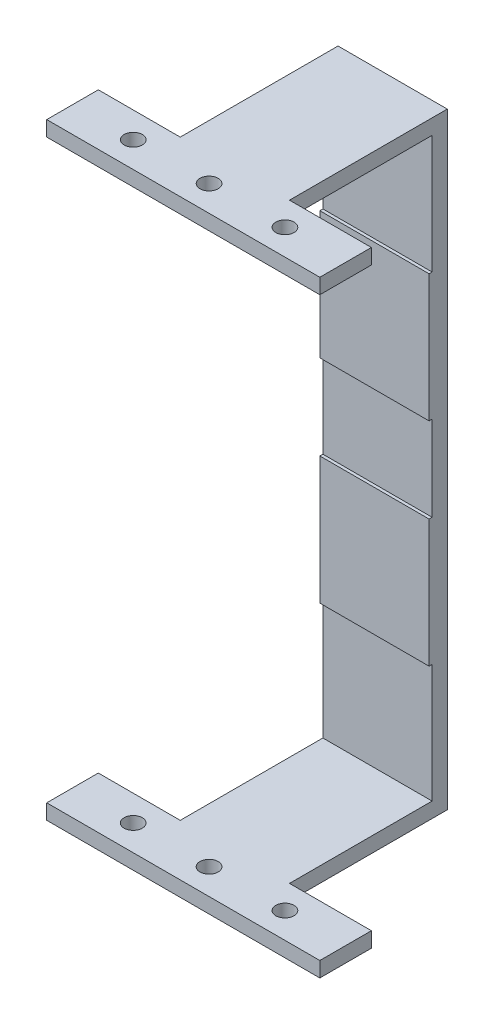
ISO-10303-21;
HEADER;
FILE_DESCRIPTION(('STEP AP214'),'2;1');
FILE_NAME('part.step','',(''),(''),'','','');
FILE_SCHEMA(('AUTOMOTIVE_DESIGN { 1 0 10303 214 1 1 1 1 }'));
ENDSEC;
DATA;
#1=APPLICATION_CONTEXT('core data for automotive mechanical design processes');
#2=APPLICATION_PROTOCOL_DEFINITION('international standard','automotive_design',2000,#1);
#3=PRODUCT_CONTEXT('',#1,'mechanical');
#4=PRODUCT('Part','Part','',(#3));
#5=PRODUCT_RELATED_PRODUCT_CATEGORY('part','',(#4));
#6=PRODUCT_DEFINITION_FORMATION('','',#4);
#7=PRODUCT_DEFINITION_CONTEXT('part definition',#1,'design');
#8=PRODUCT_DEFINITION('design','',#6,#7);
#9=PRODUCT_DEFINITION_SHAPE('','',#8);
#10=(LENGTH_UNIT() NAMED_UNIT(*) SI_UNIT(.MILLI.,.METRE.));
#11=(NAMED_UNIT(*) PLANE_ANGLE_UNIT() SI_UNIT($,.RADIAN.));
#12=(NAMED_UNIT(*) SI_UNIT($,.STERADIAN.) SOLID_ANGLE_UNIT());
#13=UNCERTAINTY_MEASURE_WITH_UNIT(LENGTH_MEASURE(1.E-05),#10,'distance_accuracy_value','');
#14=(GEOMETRIC_REPRESENTATION_CONTEXT(3) GLOBAL_UNCERTAINTY_ASSIGNED_CONTEXT((#13)) GLOBAL_UNIT_ASSIGNED_CONTEXT((#10,
#11,#12)) REPRESENTATION_CONTEXT('',''));
#15=CARTESIAN_POINT('',(0.,0.,0.));
#16=DIRECTION('',(0.,0.,1.));
#17=DIRECTION('',(1.,0.,0.));
#18=AXIS2_PLACEMENT_3D('',#15,#16,#17);
#19=CARTESIAN_POINT('',(45.,100.,-5.));
#20=DIRECTION('',(1.,0.,0.));
#21=DIRECTION('',(0.,1.,0.));
#22=AXIS2_PLACEMENT_3D('',#19,#20,#21);
#23=PLANE('',#22);
#24=DIRECTION('',(0.,0.,1.));
#25=VECTOR('',#24,1.);
#26=CARTESIAN_POINT('',(45.,-100.,-5.));
#27=LINE('',#26,#25);
#28=CARTESIAN_POINT('',(45.,-100.,47.));
#29=VERTEX_POINT('',#28);
#30=CARTESIAN_POINT('',(45.,-100.,64.));
#31=VERTEX_POINT('',#30);
#32=EDGE_CURVE('E237',#29,#31,#27,.T.);
#33=ORIENTED_EDGE('',*,*,#32,.F.);
#34=DIRECTION('',(0.,1.,0.));
#35=VECTOR('',#34,1.);
#36=CARTESIAN_POINT('',(45.,-100.,47.));
#37=LINE('',#36,#35);
#38=CARTESIAN_POINT('',(45.,-95.,47.));
#39=VERTEX_POINT('',#38);
#40=EDGE_CURVE('E259',#29,#39,#37,.T.);
#41=ORIENTED_EDGE('',*,*,#40,.T.);
#42=DIRECTION('',(0.,0.,-1.));
#43=VECTOR('',#42,1.);
#44=CARTESIAN_POINT('',(45.,-95.,64.));
#45=LINE('',#44,#43);
#46=CARTESIAN_POINT('',(45.,-95.,64.));
#47=VERTEX_POINT('',#46);
#48=EDGE_CURVE('E269',#47,#39,#45,.T.);
#49=ORIENTED_EDGE('',*,*,#48,.F.);
#50=DIRECTION('',(0.,1.,0.));
#51=VECTOR('',#50,1.);
#52=CARTESIAN_POINT('',(45.,-100.,64.));
#53=LINE('',#52,#51);
#54=EDGE_CURVE('E432',#31,#47,#53,.T.);
#55=ORIENTED_EDGE('',*,*,#54,.F.);
#56=EDGE_LOOP('',(#33,#41,#49,#55));
#57=FACE_BOUND('',#56,.T.);
#58=ADVANCED_FACE('F40',(#57),#23,.T.);
#59=DIRECTION('',(0.,0.,-1.));
#60=VECTOR('',#59,1.);
#61=CARTESIAN_POINT('',(45.,95.,64.));
#62=LINE('',#61,#60);
#63=CARTESIAN_POINT('',(45.,95.,64.));
#64=VERTEX_POINT('',#63);
#65=CARTESIAN_POINT('',(45.,95.,47.));
#66=VERTEX_POINT('',#65);
#67=EDGE_CURVE('E297',#64,#66,#62,.T.);
#68=ORIENTED_EDGE('',*,*,#67,.T.);
#69=CARTESIAN_POINT('',(45.,100.,47.));
#70=VERTEX_POINT('',#69);
#71=EDGE_CURVE('E272',#66,#70,#37,.T.);
#72=ORIENTED_EDGE('',*,*,#71,.T.);
#73=DIRECTION('',(0.,0.,1.));
#74=VECTOR('',#73,1.);
#75=CARTESIAN_POINT('',(45.,100.,-5.));
#76=LINE('',#75,#74);
#77=CARTESIAN_POINT('',(45.,100.,64.));
#78=VERTEX_POINT('',#77);
#79=EDGE_CURVE('E228',#70,#78,#76,.T.);
#80=ORIENTED_EDGE('',*,*,#79,.T.);
#81=DIRECTION('',(0.,1.,0.));
#82=VECTOR('',#81,1.);
#83=CARTESIAN_POINT('',(45.,100.,64.));
#84=LINE('',#83,#82);
#85=EDGE_CURVE('E292',#64,#78,#84,.T.);
#86=ORIENTED_EDGE('',*,*,#85,.F.);
#87=EDGE_LOOP('',(#68,#72,#80,#86));
#88=FACE_BOUND('',#87,.T.);
#89=ADVANCED_FACE('F488',(#88),#23,.T.);
#90=CARTESIAN_POINT('',(-45.,-100.,-5.));
#91=DIRECTION('',(0.,-1.,0.));
#92=DIRECTION('',(0.,0.,-1.));
#93=AXIS2_PLACEMENT_3D('',#90,#91,#92);
#94=PLANE('',#93);
#95=CARTESIAN_POINT('',(-25.,-100.,55.5));
#96=DIRECTION('',(0.,1.,0.));
#97=DIRECTION('',(0.,0.,1.));
#98=AXIS2_PLACEMENT_3D('',#95,#96,#97);
#99=CIRCLE('',#98,3.);
#100=CARTESIAN_POINT('',(-25.,-100.,58.5));
#101=VERTEX_POINT('',#100);
#102=EDGE_CURVE('E246',#101,#101,#99,.T.);
#103=ORIENTED_EDGE('',*,*,#102,.T.);
#104=EDGE_LOOP('',(#103));
#105=FACE_BOUND('',#104,.T.);
#106=CARTESIAN_POINT('',(0.,-100.,55.5));
#107=DIRECTION('',(0.,1.,0.));
#108=DIRECTION('',(0.,0.,1.));
#109=AXIS2_PLACEMENT_3D('',#106,#107,#108);
#110=CIRCLE('',#109,3.);
#111=CARTESIAN_POINT('',(0.,-100.,58.5));
#112=VERTEX_POINT('',#111);
#113=EDGE_CURVE('E355',#112,#112,#110,.T.);
#114=ORIENTED_EDGE('',*,*,#113,.T.);
#115=EDGE_LOOP('',(#114));
#116=FACE_BOUND('',#115,.T.);
#117=CARTESIAN_POINT('',(25.,-100.,55.5));
#118=DIRECTION('',(0.,1.,0.));
#119=DIRECTION('',(0.,0.,1.));
#120=AXIS2_PLACEMENT_3D('',#117,#118,#119);
#121=CIRCLE('',#120,3.);
#122=CARTESIAN_POINT('',(25.,-100.,58.5));
#123=VERTEX_POINT('',#122);
#124=EDGE_CURVE('E361',#123,#123,#121,.T.);
#125=ORIENTED_EDGE('',*,*,#124,.T.);
#126=EDGE_LOOP('',(#125));
#127=FACE_BOUND('',#126,.T.);
#128=DIRECTION('',(1.,0.,0.));
#129=VECTOR('',#128,1.);
#130=CARTESIAN_POINT('',(0.,-100.,47.));
#131=LINE('',#130,#129);
#132=CARTESIAN_POINT('',(-45.,-100.,47.));
#133=VERTEX_POINT('',#132);
#134=CARTESIAN_POINT('',(-18.,-100.,47.));
#135=VERTEX_POINT('',#134);
#136=EDGE_CURVE('E222',#133,#135,#131,.T.);
#137=ORIENTED_EDGE('',*,*,#136,.T.);
#138=DIRECTION('',(0.,0.,1.));
#139=VECTOR('',#138,1.);
#140=CARTESIAN_POINT('',(-18.,-100.,0.));
#141=LINE('',#140,#139);
#142=CARTESIAN_POINT('',(-18.,-100.,-5.));
#143=VERTEX_POINT('',#142);
#144=EDGE_CURVE('E204',#143,#135,#141,.T.);
#145=ORIENTED_EDGE('',*,*,#144,.F.);
#146=DIRECTION('',(1.,0.,0.));
#147=VECTOR('',#146,1.);
#148=CARTESIAN_POINT('',(-45.,-100.,-5.));
#149=LINE('',#148,#147);
#150=CARTESIAN_POINT('',(18.,-100.,-5.));
#151=VERTEX_POINT('',#150);
#152=EDGE_CURVE('E220',#143,#151,#149,.T.);
#153=ORIENTED_EDGE('',*,*,#152,.T.);
#154=DIRECTION('',(0.,0.,1.));
#155=VECTOR('',#154,1.);
#156=CARTESIAN_POINT('',(18.,-100.,-5.));
#157=LINE('',#156,#155);
#158=CARTESIAN_POINT('',(18.,-100.,47.));
#159=VERTEX_POINT('',#158);
#160=EDGE_CURVE('E271',#151,#159,#157,.T.);
#161=ORIENTED_EDGE('',*,*,#160,.T.);
#162=DIRECTION('',(-1.,0.,0.));
#163=VECTOR('',#162,1.);
#164=CARTESIAN_POINT('',(45.,-100.,47.));
#165=LINE('',#164,#163);
#166=EDGE_CURVE('E325',#29,#159,#165,.T.);
#167=ORIENTED_EDGE('',*,*,#166,.F.);
#168=ORIENTED_EDGE('',*,*,#32,.T.);
#169=DIRECTION('',(1.,0.,0.));
#170=VECTOR('',#169,1.);
#171=CARTESIAN_POINT('',(-45.,-100.,64.));
#172=LINE('',#171,#170);
#173=CARTESIAN_POINT('',(-45.,-100.,64.));
#174=VERTEX_POINT('',#173);
#175=EDGE_CURVE('E429',#174,#31,#172,.T.);
#176=ORIENTED_EDGE('',*,*,#175,.F.);
#177=DIRECTION('',(0.,0.,1.));
#178=VECTOR('',#177,1.);
#179=CARTESIAN_POINT('',(-45.,-100.,-5.));
#180=LINE('',#179,#178);
#181=EDGE_CURVE('E239',#133,#174,#180,.T.);
#182=ORIENTED_EDGE('',*,*,#181,.F.);
#183=EDGE_LOOP('',(#137,#145,#153,#161,#167,#168,#176,#182));
#184=FACE_BOUND('',#183,.T.);
#185=ADVANCED_FACE('F218',(#105,#116,#127,#184),#94,.T.);
#186=CARTESIAN_POINT('',(-45.,100.,-5.));
#187=DIRECTION('',(0.,1.,0.));
#188=DIRECTION('',(0.,0.,1.));
#189=AXIS2_PLACEMENT_3D('',#186,#187,#188);
#190=PLANE('',#189);
#191=CARTESIAN_POINT('',(-25.,100.,55.5));
#192=DIRECTION('',(0.,1.,0.));
#193=DIRECTION('',(0.,0.,1.));
#194=AXIS2_PLACEMENT_3D('',#191,#192,#193);
#195=CIRCLE('',#194,3.);
#196=CARTESIAN_POINT('',(-25.,100.,58.5));
#197=VERTEX_POINT('',#196);
#198=EDGE_CURVE('E352',#197,#197,#195,.T.);
#199=ORIENTED_EDGE('',*,*,#198,.F.);
#200=EDGE_LOOP('',(#199));
#201=FACE_BOUND('',#200,.T.);
#202=CARTESIAN_POINT('',(0.,100.,55.5));
#203=DIRECTION('',(0.,1.,0.));
#204=DIRECTION('',(0.,0.,1.));
#205=AXIS2_PLACEMENT_3D('',#202,#203,#204);
#206=CIRCLE('',#205,3.);
#207=CARTESIAN_POINT('',(0.,100.,58.5));
#208=VERTEX_POINT('',#207);
#209=EDGE_CURVE('E358',#208,#208,#206,.T.);
#210=ORIENTED_EDGE('',*,*,#209,.F.);
#211=EDGE_LOOP('',(#210));
#212=FACE_BOUND('',#211,.T.);
#213=CARTESIAN_POINT('',(25.,100.,55.5));
#214=DIRECTION('',(0.,1.,0.));
#215=DIRECTION('',(0.,0.,1.));
#216=AXIS2_PLACEMENT_3D('',#213,#214,#215);
#217=CIRCLE('',#216,3.);
#218=CARTESIAN_POINT('',(25.,100.,58.5));
#219=VERTEX_POINT('',#218);
#220=EDGE_CURVE('E212',#219,#219,#217,.T.);
#221=ORIENTED_EDGE('',*,*,#220,.F.);
#222=EDGE_LOOP('',(#221));
#223=FACE_BOUND('',#222,.T.);
#224=DIRECTION('',(-1.,0.,0.));
#225=VECTOR('',#224,1.);
#226=CARTESIAN_POINT('',(-45.,100.,-5.));
#227=LINE('',#226,#225);
#228=CARTESIAN_POINT('',(18.,100.,-5.));
#229=VERTEX_POINT('',#228);
#230=CARTESIAN_POINT('',(-18.,100.,-5.));
#231=VERTEX_POINT('',#230);
#232=EDGE_CURVE('E229',#229,#231,#227,.T.);
#233=ORIENTED_EDGE('',*,*,#232,.T.);
#234=DIRECTION('',(0.,0.,1.));
#235=VECTOR('',#234,1.);
#236=CARTESIAN_POINT('',(-18.,100.,0.));
#237=LINE('',#236,#235);
#238=CARTESIAN_POINT('',(-18.,100.,47.));
#239=VERTEX_POINT('',#238);
#240=EDGE_CURVE('E207',#231,#239,#237,.T.);
#241=ORIENTED_EDGE('',*,*,#240,.T.);
#242=DIRECTION('',(1.,0.,0.));
#243=VECTOR('',#242,1.);
#244=CARTESIAN_POINT('',(0.,100.,47.));
#245=LINE('',#244,#243);
#246=CARTESIAN_POINT('',(-45.,100.,47.));
#247=VERTEX_POINT('',#246);
#248=EDGE_CURVE('E223',#247,#239,#245,.T.);
#249=ORIENTED_EDGE('',*,*,#248,.F.);
#250=DIRECTION('',(0.,0.,1.));
#251=VECTOR('',#250,1.);
#252=CARTESIAN_POINT('',(-45.,100.,-5.));
#253=LINE('',#252,#251);
#254=CARTESIAN_POINT('',(-45.,100.,64.));
#255=VERTEX_POINT('',#254);
#256=EDGE_CURVE('E231',#247,#255,#253,.T.);
#257=ORIENTED_EDGE('',*,*,#256,.T.);
#258=DIRECTION('',(-1.,0.,0.));
#259=VECTOR('',#258,1.);
#260=CARTESIAN_POINT('',(-45.,100.,64.));
#261=LINE('',#260,#259);
#262=EDGE_CURVE('E295',#78,#255,#261,.T.);
#263=ORIENTED_EDGE('',*,*,#262,.F.);
#264=ORIENTED_EDGE('',*,*,#79,.F.);
#265=DIRECTION('',(-1.,0.,0.));
#266=VECTOR('',#265,1.);
#267=CARTESIAN_POINT('',(45.,100.,47.));
#268=LINE('',#267,#266);
#269=CARTESIAN_POINT('',(18.,100.,47.));
#270=VERTEX_POINT('',#269);
#271=EDGE_CURVE('E324',#70,#270,#268,.T.);
#272=ORIENTED_EDGE('',*,*,#271,.T.);
#273=DIRECTION('',(0.,0.,1.));
#274=VECTOR('',#273,1.);
#275=CARTESIAN_POINT('',(18.,100.,-5.));
#276=LINE('',#275,#274);
#277=EDGE_CURVE('E322',#229,#270,#276,.T.);
#278=ORIENTED_EDGE('',*,*,#277,.F.);
#279=EDGE_LOOP('',(#233,#241,#249,#257,#263,#264,#272,#278));
#280=FACE_BOUND('',#279,.T.);
#281=ADVANCED_FACE('F496',(#201,#212,#223,#280),#190,.T.);
#282=CARTESIAN_POINT('',(0.,0.,-5.));
#283=DIRECTION('',(0.,0.,1.));
#284=DIRECTION('',(1.,0.,0.));
#285=AXIS2_PLACEMENT_3D('',#282,#283,#284);
#286=PLANE('',#285);
#287=DIRECTION('',(0.,1.,0.));
#288=VECTOR('',#287,1.);
#289=CARTESIAN_POINT('',(-18.,95.,-5.));
#290=LINE('',#289,#288);
#291=EDGE_CURVE('E199',#143,#231,#290,.T.);
#292=ORIENTED_EDGE('',*,*,#291,.T.);
#293=ORIENTED_EDGE('',*,*,#232,.F.);
#294=DIRECTION('',(0.,-1.,0.));
#295=VECTOR('',#294,1.);
#296=CARTESIAN_POINT('',(18.,95.,-5.));
#297=LINE('',#296,#295);
#298=EDGE_CURVE('E226',#229,#151,#297,.T.);
#299=ORIENTED_EDGE('',*,*,#298,.T.);
#300=ORIENTED_EDGE('',*,*,#152,.F.);
#301=EDGE_LOOP('',(#292,#293,#299,#300));
#302=FACE_BOUND('',#301,.T.);
#303=ADVANCED_FACE('F225',(#302),#286,.F.);
#304=CARTESIAN_POINT('',(-45.,95.,64.));
#305=DIRECTION('',(0.,1.,0.));
#306=DIRECTION('',(0.,0.,1.));
#307=AXIS2_PLACEMENT_3D('',#304,#305,#306);
#308=PLANE('',#307);
#309=CARTESIAN_POINT('',(-25.,95.,55.5));
#310=DIRECTION('',(0.,1.,0.));
#311=DIRECTION('',(0.,0.,1.));
#312=AXIS2_PLACEMENT_3D('',#309,#310,#311);
#313=CIRCLE('',#312,3.);
#314=CARTESIAN_POINT('',(-25.,95.,58.5));
#315=VERTEX_POINT('',#314);
#316=EDGE_CURVE('E253',#315,#315,#313,.T.);
#317=ORIENTED_EDGE('',*,*,#316,.T.);
#318=EDGE_LOOP('',(#317));
#319=FACE_BOUND('',#318,.T.);
#320=CARTESIAN_POINT('',(0.,95.,55.5));
#321=DIRECTION('',(0.,1.,0.));
#322=DIRECTION('',(0.,0.,1.));
#323=AXIS2_PLACEMENT_3D('',#320,#321,#322);
#324=CIRCLE('',#323,3.);
#325=CARTESIAN_POINT('',(0.,95.,58.5));
#326=VERTEX_POINT('',#325);
#327=EDGE_CURVE('E250',#326,#326,#324,.T.);
#328=ORIENTED_EDGE('',*,*,#327,.T.);
#329=EDGE_LOOP('',(#328));
#330=FACE_BOUND('',#329,.T.);
#331=CARTESIAN_POINT('',(25.,95.,55.5));
#332=DIRECTION('',(0.,1.,0.));
#333=DIRECTION('',(0.,0.,1.));
#334=AXIS2_PLACEMENT_3D('',#331,#332,#333);
#335=CIRCLE('',#334,3.);
#336=CARTESIAN_POINT('',(25.,95.,58.5));
#337=VERTEX_POINT('',#336);
#338=EDGE_CURVE('E245',#337,#337,#335,.T.);
#339=ORIENTED_EDGE('',*,*,#338,.T.);
#340=EDGE_LOOP('',(#339));
#341=FACE_BOUND('',#340,.T.);
#342=DIRECTION('',(0.,0.,1.));
#343=VECTOR('',#342,1.);
#344=CARTESIAN_POINT('',(-18.,95.,64.));
#345=LINE('',#344,#343);
#346=CARTESIAN_POINT('',(-18.,95.,0.));
#347=VERTEX_POINT('',#346);
#348=CARTESIAN_POINT('',(-18.,95.,47.));
#349=VERTEX_POINT('',#348);
#350=EDGE_CURVE('E332',#347,#349,#345,.T.);
#351=ORIENTED_EDGE('',*,*,#350,.F.);
#352=DIRECTION('',(1.,0.,0.));
#353=VECTOR('',#352,1.);
#354=CARTESIAN_POINT('',(-45.,95.,0.));
#355=LINE('',#354,#353);
#356=CARTESIAN_POINT('',(18.,95.,0.));
#357=VERTEX_POINT('',#356);
#358=EDGE_CURVE('E278',#347,#357,#355,.T.);
#359=ORIENTED_EDGE('',*,*,#358,.T.);
#360=DIRECTION('',(0.,0.,1.));
#361=VECTOR('',#360,1.);
#362=CARTESIAN_POINT('',(18.,95.,64.));
#363=LINE('',#362,#361);
#364=CARTESIAN_POINT('',(18.,95.,47.));
#365=VERTEX_POINT('',#364);
#366=EDGE_CURVE('E333',#357,#365,#363,.T.);
#367=ORIENTED_EDGE('',*,*,#366,.T.);
#368=DIRECTION('',(-1.,0.,0.));
#369=VECTOR('',#368,1.);
#370=CARTESIAN_POINT('',(-45.,95.,47.));
#371=LINE('',#370,#369);
#372=EDGE_CURVE('E338',#66,#365,#371,.T.);
#373=ORIENTED_EDGE('',*,*,#372,.F.);
#374=ORIENTED_EDGE('',*,*,#67,.F.);
#375=DIRECTION('',(1.,0.,0.));
#376=VECTOR('',#375,1.);
#377=CARTESIAN_POINT('',(-45.,95.,64.));
#378=LINE('',#377,#376);
#379=CARTESIAN_POINT('',(-45.,95.,64.));
#380=VERTEX_POINT('',#379);
#381=EDGE_CURVE('E290',#380,#64,#378,.T.);
#382=ORIENTED_EDGE('',*,*,#381,.F.);
#383=DIRECTION('',(0.,0.,-1.));
#384=VECTOR('',#383,1.);
#385=CARTESIAN_POINT('',(-45.,95.,64.));
#386=LINE('',#385,#384);
#387=CARTESIAN_POINT('',(-45.,95.,47.));
#388=VERTEX_POINT('',#387);
#389=EDGE_CURVE('E233',#380,#388,#386,.T.);
#390=ORIENTED_EDGE('',*,*,#389,.T.);
#391=DIRECTION('',(1.,0.,0.));
#392=VECTOR('',#391,1.);
#393=CARTESIAN_POINT('',(-45.,95.,47.));
#394=LINE('',#393,#392);
#395=EDGE_CURVE('E305',#388,#349,#394,.T.);
#396=ORIENTED_EDGE('',*,*,#395,.T.);
#397=EDGE_LOOP('',(#351,#359,#367,#373,#374,#382,#390,#396));
#398=FACE_BOUND('',#397,.T.);
#399=ADVANCED_FACE('F304',(#319,#330,#341,#398),#308,.F.);
#400=CARTESIAN_POINT('',(-45.,-95.,64.));
#401=DIRECTION('',(0.,-1.,0.));
#402=DIRECTION('',(0.,0.,-1.));
#403=AXIS2_PLACEMENT_3D('',#400,#401,#402);
#404=PLANE('',#403);
#405=CARTESIAN_POINT('',(-25.,-95.,55.5));
#406=DIRECTION('',(0.,-1.,0.));
#407=DIRECTION('',(0.,0.,-1.));
#408=AXIS2_PLACEMENT_3D('',#405,#406,#407);
#409=CIRCLE('',#408,3.);
#410=CARTESIAN_POINT('',(-25.,-95.,52.5));
#411=VERTEX_POINT('',#410);
#412=EDGE_CURVE('E251',#411,#411,#409,.T.);
#413=ORIENTED_EDGE('',*,*,#412,.T.);
#414=EDGE_LOOP('',(#413));
#415=FACE_BOUND('',#414,.T.);
#416=CARTESIAN_POINT('',(0.,-95.,55.5));
#417=DIRECTION('',(0.,-1.,0.));
#418=DIRECTION('',(0.,0.,-1.));
#419=AXIS2_PLACEMENT_3D('',#416,#417,#418);
#420=CIRCLE('',#419,3.);
#421=CARTESIAN_POINT('',(0.,-95.,52.5));
#422=VERTEX_POINT('',#421);
#423=EDGE_CURVE('E247',#422,#422,#420,.T.);
#424=ORIENTED_EDGE('',*,*,#423,.T.);
#425=EDGE_LOOP('',(#424));
#426=FACE_BOUND('',#425,.T.);
#427=CARTESIAN_POINT('',(25.,-95.,55.5));
#428=DIRECTION('',(0.,-1.,0.));
#429=DIRECTION('',(0.,0.,-1.));
#430=AXIS2_PLACEMENT_3D('',#427,#428,#429);
#431=CIRCLE('',#430,3.);
#432=CARTESIAN_POINT('',(25.,-95.,52.5));
#433=VERTEX_POINT('',#432);
#434=EDGE_CURVE('E242',#433,#433,#431,.T.);
#435=ORIENTED_EDGE('',*,*,#434,.T.);
#436=EDGE_LOOP('',(#435));
#437=FACE_BOUND('',#436,.T.);
#438=DIRECTION('',(0.,0.,-1.));
#439=VECTOR('',#438,1.);
#440=CARTESIAN_POINT('',(-18.,-95.,64.));
#441=LINE('',#440,#439);
#442=CARTESIAN_POINT('',(-18.,-95.,47.));
#443=VERTEX_POINT('',#442);
#444=CARTESIAN_POINT('',(-18.,-95.,0.));
#445=VERTEX_POINT('',#444);
#446=EDGE_CURVE('E336',#443,#445,#441,.T.);
#447=ORIENTED_EDGE('',*,*,#446,.F.);
#448=DIRECTION('',(-1.,0.,0.));
#449=VECTOR('',#448,1.);
#450=CARTESIAN_POINT('',(-45.,-95.,47.));
#451=LINE('',#450,#449);
#452=CARTESIAN_POINT('',(-45.,-95.,47.));
#453=VERTEX_POINT('',#452);
#454=EDGE_CURVE('E11',#443,#453,#451,.T.);
#455=ORIENTED_EDGE('',*,*,#454,.T.);
#456=DIRECTION('',(0.,0.,-1.));
#457=VECTOR('',#456,1.);
#458=CARTESIAN_POINT('',(-45.,-95.,64.));
#459=LINE('',#458,#457);
#460=CARTESIAN_POINT('',(-45.,-95.,64.));
#461=VERTEX_POINT('',#460);
#462=EDGE_CURVE('E279',#461,#453,#459,.T.);
#463=ORIENTED_EDGE('',*,*,#462,.F.);
#464=DIRECTION('',(-1.,0.,0.));
#465=VECTOR('',#464,1.);
#466=CARTESIAN_POINT('',(-45.,-95.,64.));
#467=LINE('',#466,#465);
#468=EDGE_CURVE('E277',#47,#461,#467,.T.);
#469=ORIENTED_EDGE('',*,*,#468,.F.);
#470=ORIENTED_EDGE('',*,*,#48,.T.);
#471=DIRECTION('',(1.,0.,0.));
#472=VECTOR('',#471,1.);
#473=CARTESIAN_POINT('',(-45.,-95.,47.));
#474=LINE('',#473,#472);
#475=CARTESIAN_POINT('',(18.,-95.,47.));
#476=VERTEX_POINT('',#475);
#477=EDGE_CURVE('E47',#476,#39,#474,.T.);
#478=ORIENTED_EDGE('',*,*,#477,.F.);
#479=DIRECTION('',(0.,0.,-1.));
#480=VECTOR('',#479,1.);
#481=CARTESIAN_POINT('',(18.,-95.,64.));
#482=LINE('',#481,#480);
#483=CARTESIAN_POINT('',(18.,-95.,0.));
#484=VERTEX_POINT('',#483);
#485=EDGE_CURVE('E330',#476,#484,#482,.T.);
#486=ORIENTED_EDGE('',*,*,#485,.T.);
#487=DIRECTION('',(-1.,0.,0.));
#488=VECTOR('',#487,1.);
#489=CARTESIAN_POINT('',(-45.,-95.,0.));
#490=LINE('',#489,#488);
#491=EDGE_CURVE('E425',#484,#445,#490,.T.);
#492=ORIENTED_EDGE('',*,*,#491,.T.);
#493=EDGE_LOOP('',(#447,#455,#463,#469,#470,#478,#486,#492));
#494=FACE_BOUND('',#493,.T.);
#495=ADVANCED_FACE('F275',(#415,#426,#437,#494),#404,.F.);
#496=CARTESIAN_POINT('',(0.,0.,0.));
#497=DIRECTION('',(0.,0.,1.));
#498=DIRECTION('',(1.,0.,0.));
#499=AXIS2_PLACEMENT_3D('',#496,#497,#498);
#500=PLANE('',#499);
#501=DIRECTION('',(0.,1.,0.));
#502=VECTOR('',#501,1.);
#503=CARTESIAN_POINT('',(-18.,95.,0.));
#504=LINE('',#503,#502);
#505=CARTESIAN_POINT('',(-18.,-56.,0.));
#506=VERTEX_POINT('',#505);
#507=EDGE_CURVE('E213',#445,#506,#504,.T.);
#508=ORIENTED_EDGE('',*,*,#507,.F.);
#509=ORIENTED_EDGE('',*,*,#491,.F.);
#510=DIRECTION('',(0.,-1.,0.));
#511=VECTOR('',#510,1.);
#512=CARTESIAN_POINT('',(18.,95.,0.));
#513=LINE('',#512,#511);
#514=CARTESIAN_POINT('',(18.,-56.,0.));
#515=VERTEX_POINT('',#514);
#516=EDGE_CURVE('E341',#515,#484,#513,.T.);
#517=ORIENTED_EDGE('',*,*,#516,.F.);
#518=DIRECTION('',(1.,0.,0.));
#519=VECTOR('',#518,1.);
#520=CARTESIAN_POINT('',(18.,-56.,0.));
#521=LINE('',#520,#519);
#522=EDGE_CURVE('E377',#506,#515,#521,.T.);
#523=ORIENTED_EDGE('',*,*,#522,.F.);
#524=EDGE_LOOP('',(#508,#509,#517,#523));
#525=FACE_BOUND('',#524,.T.);
#526=ADVANCED_FACE('F439',(#525),#500,.T.);
#527=CARTESIAN_POINT('',(-18.,-14.,0.));
#528=VERTEX_POINT('',#527);
#529=CARTESIAN_POINT('',(-18.,14.,0.));
#530=VERTEX_POINT('',#529);
#531=EDGE_CURVE('E344',#528,#530,#504,.T.);
#532=ORIENTED_EDGE('',*,*,#531,.F.);
#533=DIRECTION('',(-1.,0.,0.));
#534=VECTOR('',#533,1.);
#535=CARTESIAN_POINT('',(-18.,-14.,0.));
#536=LINE('',#535,#534);
#537=CARTESIAN_POINT('',(18.,-14.,0.));
#538=VERTEX_POINT('',#537);
#539=EDGE_CURVE('E372',#538,#528,#536,.T.);
#540=ORIENTED_EDGE('',*,*,#539,.F.);
#541=CARTESIAN_POINT('',(18.,14.,0.));
#542=VERTEX_POINT('',#541);
#543=EDGE_CURVE('E349',#542,#538,#513,.T.);
#544=ORIENTED_EDGE('',*,*,#543,.F.);
#545=DIRECTION('',(1.,0.,0.));
#546=VECTOR('',#545,1.);
#547=CARTESIAN_POINT('',(-18.,14.,0.));
#548=LINE('',#547,#546);
#549=EDGE_CURVE('E404',#530,#542,#548,.T.);
#550=ORIENTED_EDGE('',*,*,#549,.F.);
#551=EDGE_LOOP('',(#532,#540,#544,#550));
#552=FACE_BOUND('',#551,.T.);
#553=ADVANCED_FACE('F457',(#552),#500,.T.);
#554=CARTESIAN_POINT('',(-45.,100.,-5.));
#555=DIRECTION('',(-1.,0.,0.));
#556=DIRECTION('',(0.,-1.,0.));
#557=AXIS2_PLACEMENT_3D('',#554,#555,#556);
#558=PLANE('',#557);
#559=DIRECTION('',(0.,1.,0.));
#560=VECTOR('',#559,1.);
#561=CARTESIAN_POINT('',(-45.,-100.,47.));
#562=LINE('',#561,#560);
#563=EDGE_CURVE('E312',#388,#247,#562,.T.);
#564=ORIENTED_EDGE('',*,*,#563,.F.);
#565=ORIENTED_EDGE('',*,*,#389,.F.);
#566=DIRECTION('',(0.,-1.,0.));
#567=VECTOR('',#566,1.);
#568=CARTESIAN_POINT('',(-45.,100.,64.));
#569=LINE('',#568,#567);
#570=EDGE_CURVE('E282',#255,#380,#569,.T.);
#571=ORIENTED_EDGE('',*,*,#570,.F.);
#572=ORIENTED_EDGE('',*,*,#256,.F.);
#573=EDGE_LOOP('',(#564,#565,#571,#572));
#574=FACE_BOUND('',#573,.T.);
#575=ADVANCED_FACE('F310',(#574),#558,.T.);
#576=CARTESIAN_POINT('',(-18.,56.,0.));
#577=VERTEX_POINT('',#576);
#578=EDGE_CURVE('E345',#577,#347,#504,.T.);
#579=ORIENTED_EDGE('',*,*,#578,.F.);
#580=DIRECTION('',(-1.,0.,0.));
#581=VECTOR('',#580,1.);
#582=CARTESIAN_POINT('',(-18.,56.,0.));
#583=LINE('',#582,#581);
#584=CARTESIAN_POINT('',(18.,56.,0.));
#585=VERTEX_POINT('',#584);
#586=EDGE_CURVE('E399',#585,#577,#583,.T.);
#587=ORIENTED_EDGE('',*,*,#586,.F.);
#588=EDGE_CURVE('E347',#357,#585,#513,.T.);
#589=ORIENTED_EDGE('',*,*,#588,.F.);
#590=ORIENTED_EDGE('',*,*,#358,.F.);
#591=EDGE_LOOP('',(#579,#587,#589,#590));
#592=FACE_BOUND('',#591,.T.);
#593=ADVANCED_FACE('F466',(#592),#500,.T.);
#594=EDGE_CURVE('E314',#133,#453,#562,.T.);
#595=ORIENTED_EDGE('',*,*,#594,.F.);
#596=ORIENTED_EDGE('',*,*,#181,.T.);
#597=DIRECTION('',(0.,-1.,0.));
#598=VECTOR('',#597,1.);
#599=CARTESIAN_POINT('',(-45.,-100.,64.));
#600=LINE('',#599,#598);
#601=EDGE_CURVE('E426',#461,#174,#600,.T.);
#602=ORIENTED_EDGE('',*,*,#601,.F.);
#603=ORIENTED_EDGE('',*,*,#462,.T.);
#604=EDGE_LOOP('',(#595,#596,#602,#603));
#605=FACE_BOUND('',#604,.T.);
#606=ADVANCED_FACE('F526',(#605),#558,.T.);
#607=CARTESIAN_POINT('',(0.,0.,64.));
#608=DIRECTION('',(0.,0.,1.));
#609=DIRECTION('',(1.,0.,0.));
#610=AXIS2_PLACEMENT_3D('',#607,#608,#609);
#611=PLANE('',#610);
#612=ORIENTED_EDGE('',*,*,#570,.T.);
#613=ORIENTED_EDGE('',*,*,#381,.T.);
#614=ORIENTED_EDGE('',*,*,#85,.T.);
#615=ORIENTED_EDGE('',*,*,#262,.T.);
#616=EDGE_LOOP('',(#612,#613,#614,#615));
#617=FACE_BOUND('',#616,.T.);
#618=ADVANCED_FACE('F504',(#617),#611,.T.);
#619=CARTESIAN_POINT('',(0.,0.,64.));
#620=DIRECTION('',(0.,0.,-1.));
#621=DIRECTION('',(-1.,0.,0.));
#622=AXIS2_PLACEMENT_3D('',#619,#620,#621);
#623=PLANE('',#622);
#624=ORIENTED_EDGE('',*,*,#601,.T.);
#625=ORIENTED_EDGE('',*,*,#175,.T.);
#626=ORIENTED_EDGE('',*,*,#54,.T.);
#627=ORIENTED_EDGE('',*,*,#468,.T.);
#628=EDGE_LOOP('',(#624,#625,#626,#627));
#629=FACE_BOUND('',#628,.T.);
#630=ADVANCED_FACE('F529',(#629),#623,.F.);
#631=CARTESIAN_POINT('',(18.,14.,1.));
#632=DIRECTION('',(-1.,0.,0.));
#633=DIRECTION('',(0.,-1.,0.));
#634=AXIS2_PLACEMENT_3D('',#631,#632,#633);
#635=PLANE('',#634);
#636=DIRECTION('',(0.,0.,-1.));
#637=VECTOR('',#636,1.);
#638=CARTESIAN_POINT('',(18.,14.,1.));
#639=LINE('',#638,#637);
#640=CARTESIAN_POINT('',(18.,14.,1.));
#641=VERTEX_POINT('',#640);
#642=EDGE_CURVE('E410',#641,#542,#639,.T.);
#643=ORIENTED_EDGE('',*,*,#642,.T.);
#644=ORIENTED_EDGE('',*,*,#543,.T.);
#645=DIRECTION('',(0.,0.,-1.));
#646=VECTOR('',#645,1.);
#647=CARTESIAN_POINT('',(18.,-14.,1.));
#648=LINE('',#647,#646);
#649=CARTESIAN_POINT('',(18.,-14.,1.));
#650=VERTEX_POINT('',#649);
#651=EDGE_CURVE('E383',#650,#538,#648,.T.);
#652=ORIENTED_EDGE('',*,*,#651,.F.);
#653=DIRECTION('',(0.,1.,0.));
#654=VECTOR('',#653,1.);
#655=CARTESIAN_POINT('',(18.,-14.,1.));
#656=LINE('',#655,#654);
#657=CARTESIAN_POINT('',(18.,-56.,1.));
#658=VERTEX_POINT('',#657);
#659=EDGE_CURVE('E381',#658,#650,#656,.T.);
#660=ORIENTED_EDGE('',*,*,#659,.F.);
#661=DIRECTION('',(0.,0.,-1.));
#662=VECTOR('',#661,1.);
#663=CARTESIAN_POINT('',(18.,-56.,1.));
#664=LINE('',#663,#662);
#665=EDGE_CURVE('E390',#658,#515,#664,.T.);
#666=ORIENTED_EDGE('',*,*,#665,.T.);
#667=ORIENTED_EDGE('',*,*,#516,.T.);
#668=ORIENTED_EDGE('',*,*,#485,.F.);
#669=DIRECTION('',(0.,1.,0.));
#670=VECTOR('',#669,1.);
#671=CARTESIAN_POINT('',(18.,-100.,47.));
#672=LINE('',#671,#670);
#673=EDGE_CURVE('E262',#159,#476,#672,.T.);
#674=ORIENTED_EDGE('',*,*,#673,.F.);
#675=ORIENTED_EDGE('',*,*,#160,.F.);
#676=ORIENTED_EDGE('',*,*,#298,.F.);
#677=ORIENTED_EDGE('',*,*,#277,.T.);
#678=EDGE_CURVE('E62',#365,#270,#672,.T.);
#679=ORIENTED_EDGE('',*,*,#678,.F.);
#680=ORIENTED_EDGE('',*,*,#366,.F.);
#681=ORIENTED_EDGE('',*,*,#588,.T.);
#682=DIRECTION('',(0.,0.,-1.));
#683=VECTOR('',#682,1.);
#684=CARTESIAN_POINT('',(18.,56.,1.));
#685=LINE('',#684,#683);
#686=CARTESIAN_POINT('',(18.,56.,1.));
#687=VERTEX_POINT('',#686);
#688=EDGE_CURVE('E422',#687,#585,#685,.T.);
#689=ORIENTED_EDGE('',*,*,#688,.F.);
#690=DIRECTION('',(0.,1.,0.));
#691=VECTOR('',#690,1.);
#692=CARTESIAN_POINT('',(18.,14.,1.));
#693=LINE('',#692,#691);
#694=EDGE_CURVE('E400',#641,#687,#693,.T.);
#695=ORIENTED_EDGE('',*,*,#694,.F.);
#696=EDGE_LOOP('',(#643,#644,#652,#660,#666,#667,#668,#674,#675,#676,#677,#679,#680,#681,#689,#695));
#697=FACE_BOUND('',#696,.T.);
#698=ADVANCED_FACE('F468',(#697),#635,.F.);
#699=CARTESIAN_POINT('',(-18.,56.,1.));
#700=DIRECTION('',(0.,-1.,0.));
#701=DIRECTION('',(0.,0.,-1.));
#702=AXIS2_PLACEMENT_3D('',#699,#700,#701);
#703=PLANE('',#702);
#704=ORIENTED_EDGE('',*,*,#586,.T.);
#705=DIRECTION('',(0.,0.,-1.));
#706=VECTOR('',#705,1.);
#707=CARTESIAN_POINT('',(-18.,56.,1.));
#708=LINE('',#707,#706);
#709=CARTESIAN_POINT('',(-18.,56.,1.));
#710=VERTEX_POINT('',#709);
#711=EDGE_CURVE('E420',#710,#577,#708,.T.);
#712=ORIENTED_EDGE('',*,*,#711,.F.);
#713=DIRECTION('',(-1.,0.,0.));
#714=VECTOR('',#713,1.);
#715=CARTESIAN_POINT('',(-18.,56.,1.));
#716=LINE('',#715,#714);
#717=EDGE_CURVE('E403',#687,#710,#716,.T.);
#718=ORIENTED_EDGE('',*,*,#717,.F.);
#719=ORIENTED_EDGE('',*,*,#688,.T.);
#720=EDGE_LOOP('',(#704,#712,#718,#719));
#721=FACE_BOUND('',#720,.T.);
#722=ADVANCED_FACE('F472',(#721),#703,.F.);
#723=CARTESIAN_POINT('',(-18.,14.,1.));
#724=DIRECTION('',(1.,0.,0.));
#725=DIRECTION('',(0.,0.,-1.));
#726=AXIS2_PLACEMENT_3D('',#723,#724,#725);
#727=PLANE('',#726);
#728=ORIENTED_EDGE('',*,*,#711,.T.);
#729=ORIENTED_EDGE('',*,*,#578,.T.);
#730=ORIENTED_EDGE('',*,*,#350,.T.);
#731=DIRECTION('',(0.,1.,0.));
#732=VECTOR('',#731,1.);
#733=CARTESIAN_POINT('',(-18.,-100.,47.));
#734=LINE('',#733,#732);
#735=EDGE_CURVE('E54',#349,#239,#734,.T.);
#736=ORIENTED_EDGE('',*,*,#735,.T.);
#737=ORIENTED_EDGE('',*,*,#240,.F.);
#738=ORIENTED_EDGE('',*,*,#291,.F.);
#739=ORIENTED_EDGE('',*,*,#144,.T.);
#740=EDGE_CURVE('E319',#135,#443,#734,.T.);
#741=ORIENTED_EDGE('',*,*,#740,.T.);
#742=ORIENTED_EDGE('',*,*,#446,.T.);
#743=ORIENTED_EDGE('',*,*,#507,.T.);
#744=DIRECTION('',(0.,0.,-1.));
#745=VECTOR('',#744,1.);
#746=CARTESIAN_POINT('',(-18.,-56.,1.));
#747=LINE('',#746,#745);
#748=CARTESIAN_POINT('',(-18.,-56.,1.));
#749=VERTEX_POINT('',#748);
#750=EDGE_CURVE('E393',#749,#506,#747,.T.);
#751=ORIENTED_EDGE('',*,*,#750,.F.);
#752=DIRECTION('',(0.,-1.,0.));
#753=VECTOR('',#752,1.);
#754=CARTESIAN_POINT('',(-18.,-14.,1.));
#755=LINE('',#754,#753);
#756=CARTESIAN_POINT('',(-18.,-14.,1.));
#757=VERTEX_POINT('',#756);
#758=EDGE_CURVE('E376',#757,#749,#755,.T.);
#759=ORIENTED_EDGE('',*,*,#758,.F.);
#760=DIRECTION('',(0.,0.,-1.));
#761=VECTOR('',#760,1.);
#762=CARTESIAN_POINT('',(-18.,-14.,1.));
#763=LINE('',#762,#761);
#764=EDGE_CURVE('E396',#757,#528,#763,.T.);
#765=ORIENTED_EDGE('',*,*,#764,.T.);
#766=ORIENTED_EDGE('',*,*,#531,.T.);
#767=DIRECTION('',(0.,0.,-1.));
#768=VECTOR('',#767,1.);
#769=CARTESIAN_POINT('',(-18.,14.,1.));
#770=LINE('',#769,#768);
#771=CARTESIAN_POINT('',(-18.,14.,1.));
#772=VERTEX_POINT('',#771);
#773=EDGE_CURVE('E417',#772,#530,#770,.T.);
#774=ORIENTED_EDGE('',*,*,#773,.F.);
#775=DIRECTION('',(0.,-1.,0.));
#776=VECTOR('',#775,1.);
#777=CARTESIAN_POINT('',(-18.,14.,1.));
#778=LINE('',#777,#776);
#779=EDGE_CURVE('E406',#710,#772,#778,.T.);
#780=ORIENTED_EDGE('',*,*,#779,.F.);
#781=EDGE_LOOP('',(#728,#729,#730,#736,#737,#738,#739,#741,#742,#743,#751,#759,#765,#766,#774,#780));
#782=FACE_BOUND('',#781,.T.);
#783=ADVANCED_FACE('F202',(#782),#727,.F.);
#784=CARTESIAN_POINT('',(-18.,14.,1.));
#785=DIRECTION('',(0.,1.,0.));
#786=DIRECTION('',(0.,0.,1.));
#787=AXIS2_PLACEMENT_3D('',#784,#785,#786);
#788=PLANE('',#787);
#789=ORIENTED_EDGE('',*,*,#549,.T.);
#790=ORIENTED_EDGE('',*,*,#642,.F.);
#791=DIRECTION('',(1.,0.,0.));
#792=VECTOR('',#791,1.);
#793=CARTESIAN_POINT('',(-18.,14.,1.));
#794=LINE('',#793,#792);
#795=EDGE_CURVE('E408',#772,#641,#794,.T.);
#796=ORIENTED_EDGE('',*,*,#795,.F.);
#797=ORIENTED_EDGE('',*,*,#773,.T.);
#798=EDGE_LOOP('',(#789,#790,#796,#797));
#799=FACE_BOUND('',#798,.T.);
#800=ADVANCED_FACE('F478',(#799),#788,.F.);
#801=CARTESIAN_POINT('',(0.,0.,1.));
#802=DIRECTION('',(0.,0.,-1.));
#803=DIRECTION('',(-1.,0.,0.));
#804=AXIS2_PLACEMENT_3D('',#801,#802,#803);
#805=PLANE('',#804);
#806=ORIENTED_EDGE('',*,*,#694,.T.);
#807=ORIENTED_EDGE('',*,*,#717,.T.);
#808=ORIENTED_EDGE('',*,*,#779,.T.);
#809=ORIENTED_EDGE('',*,*,#795,.T.);
#810=EDGE_LOOP('',(#806,#807,#808,#809));
#811=FACE_BOUND('',#810,.T.);
#812=ADVANCED_FACE('F474',(#811),#805,.F.);
#813=CARTESIAN_POINT('',(-18.,-14.,1.));
#814=DIRECTION('',(0.,-1.,0.));
#815=DIRECTION('',(0.,0.,-1.));
#816=AXIS2_PLACEMENT_3D('',#813,#814,#815);
#817=PLANE('',#816);
#818=ORIENTED_EDGE('',*,*,#539,.T.);
#819=ORIENTED_EDGE('',*,*,#764,.F.);
#820=DIRECTION('',(-1.,0.,0.));
#821=VECTOR('',#820,1.);
#822=CARTESIAN_POINT('',(-18.,-14.,1.));
#823=LINE('',#822,#821);
#824=EDGE_CURVE('E373',#650,#757,#823,.T.);
#825=ORIENTED_EDGE('',*,*,#824,.F.);
#826=ORIENTED_EDGE('',*,*,#651,.T.);
#827=EDGE_LOOP('',(#818,#819,#825,#826));
#828=FACE_BOUND('',#827,.T.);
#829=ADVANCED_FACE('F455',(#828),#817,.F.);
#830=CARTESIAN_POINT('',(18.,-56.,1.));
#831=DIRECTION('',(0.,1.,0.));
#832=DIRECTION('',(0.,0.,1.));
#833=AXIS2_PLACEMENT_3D('',#830,#831,#832);
#834=PLANE('',#833);
#835=ORIENTED_EDGE('',*,*,#522,.T.);
#836=ORIENTED_EDGE('',*,*,#665,.F.);
#837=DIRECTION('',(1.,0.,0.));
#838=VECTOR('',#837,1.);
#839=CARTESIAN_POINT('',(18.,-56.,1.));
#840=LINE('',#839,#838);
#841=EDGE_CURVE('E379',#749,#658,#840,.T.);
#842=ORIENTED_EDGE('',*,*,#841,.F.);
#843=ORIENTED_EDGE('',*,*,#750,.T.);
#844=EDGE_LOOP('',(#835,#836,#842,#843));
#845=FACE_BOUND('',#844,.T.);
#846=ADVANCED_FACE('F444',(#845),#834,.F.);
#847=CARTESIAN_POINT('',(0.,0.,1.));
#848=DIRECTION('',(0.,0.,-1.));
#849=DIRECTION('',(-1.,0.,0.));
#850=AXIS2_PLACEMENT_3D('',#847,#848,#849);
#851=PLANE('',#850);
#852=ORIENTED_EDGE('',*,*,#824,.T.);
#853=ORIENTED_EDGE('',*,*,#758,.T.);
#854=ORIENTED_EDGE('',*,*,#841,.T.);
#855=ORIENTED_EDGE('',*,*,#659,.T.);
#856=EDGE_LOOP('',(#852,#853,#854,#855));
#857=FACE_BOUND('',#856,.T.);
#858=ADVANCED_FACE('F448',(#857),#851,.F.);
#859=CARTESIAN_POINT('',(25.,-100.,55.5));
#860=DIRECTION('',(0.,1.,0.));
#861=DIRECTION('',(0.,0.,1.));
#862=AXIS2_PLACEMENT_3D('',#859,#860,#861);
#863=CYLINDRICAL_SURFACE('',#862,3.);
#864=ORIENTED_EDGE('',*,*,#124,.F.);
#865=EDGE_LOOP('',(#864));
#866=FACE_BOUND('',#865,.T.);
#867=ORIENTED_EDGE('',*,*,#434,.F.);
#868=EDGE_LOOP('',(#867));
#869=FACE_BOUND('',#868,.T.);
#870=ADVANCED_FACE('F568',(#866,#869),#863,.F.);
#871=CARTESIAN_POINT('',(0.,-100.,55.5));
#872=DIRECTION('',(0.,1.,0.));
#873=DIRECTION('',(0.,0.,1.));
#874=AXIS2_PLACEMENT_3D('',#871,#872,#873);
#875=CYLINDRICAL_SURFACE('',#874,3.);
#876=ORIENTED_EDGE('',*,*,#113,.F.);
#877=EDGE_LOOP('',(#876));
#878=FACE_BOUND('',#877,.T.);
#879=ORIENTED_EDGE('',*,*,#423,.F.);
#880=EDGE_LOOP('',(#879));
#881=FACE_BOUND('',#880,.T.);
#882=ADVANCED_FACE('F577',(#878,#881),#875,.F.);
#883=CARTESIAN_POINT('',(-25.,-100.,55.5));
#884=DIRECTION('',(0.,1.,0.));
#885=DIRECTION('',(0.,0.,1.));
#886=AXIS2_PLACEMENT_3D('',#883,#884,#885);
#887=CYLINDRICAL_SURFACE('',#886,3.);
#888=ORIENTED_EDGE('',*,*,#102,.F.);
#889=EDGE_LOOP('',(#888));
#890=FACE_BOUND('',#889,.T.);
#891=ORIENTED_EDGE('',*,*,#412,.F.);
#892=EDGE_LOOP('',(#891));
#893=FACE_BOUND('',#892,.T.);
#894=ADVANCED_FACE('F566',(#890,#893),#887,.F.);
#895=ORIENTED_EDGE('',*,*,#220,.T.);
#896=EDGE_LOOP('',(#895));
#897=FACE_BOUND('',#896,.T.);
#898=ORIENTED_EDGE('',*,*,#338,.F.);
#899=EDGE_LOOP('',(#898));
#900=FACE_BOUND('',#899,.T.);
#901=ADVANCED_FACE('F562',(#897,#900),#863,.F.);
#902=ORIENTED_EDGE('',*,*,#209,.T.);
#903=EDGE_LOOP('',(#902));
#904=FACE_BOUND('',#903,.T.);
#905=ORIENTED_EDGE('',*,*,#327,.F.);
#906=EDGE_LOOP('',(#905));
#907=FACE_BOUND('',#906,.T.);
#908=ADVANCED_FACE('F565',(#904,#907),#875,.F.);
#909=ORIENTED_EDGE('',*,*,#198,.T.);
#910=EDGE_LOOP('',(#909));
#911=FACE_BOUND('',#910,.T.);
#912=ORIENTED_EDGE('',*,*,#316,.F.);
#913=EDGE_LOOP('',(#912));
#914=FACE_BOUND('',#913,.T.);
#915=ADVANCED_FACE('F522',(#911,#914),#887,.F.);
#916=CARTESIAN_POINT('',(45.,-100.,47.));
#917=DIRECTION('',(0.,0.,-1.));
#918=DIRECTION('',(-1.,0.,0.));
#919=AXIS2_PLACEMENT_3D('',#916,#917,#918);
#920=PLANE('',#919);
#921=ORIENTED_EDGE('',*,*,#477,.T.);
#922=ORIENTED_EDGE('',*,*,#40,.F.);
#923=ORIENTED_EDGE('',*,*,#166,.T.);
#924=ORIENTED_EDGE('',*,*,#673,.T.);
#925=EDGE_LOOP('',(#921,#922,#923,#924));
#926=FACE_BOUND('',#925,.T.);
#927=ADVANCED_FACE('F258',(#926),#920,.T.);
#928=CARTESIAN_POINT('',(0.,-100.,47.));
#929=DIRECTION('',(0.,0.,1.));
#930=DIRECTION('',(1.,0.,0.));
#931=AXIS2_PLACEMENT_3D('',#928,#929,#930);
#932=PLANE('',#931);
#933=ORIENTED_EDGE('',*,*,#740,.F.);
#934=ORIENTED_EDGE('',*,*,#136,.F.);
#935=ORIENTED_EDGE('',*,*,#594,.T.);
#936=ORIENTED_EDGE('',*,*,#454,.F.);
#937=EDGE_LOOP('',(#933,#934,#935,#936));
#938=FACE_BOUND('',#937,.T.);
#939=ADVANCED_FACE('F511',(#938),#932,.F.);
#940=ORIENTED_EDGE('',*,*,#372,.T.);
#941=ORIENTED_EDGE('',*,*,#678,.T.);
#942=ORIENTED_EDGE('',*,*,#271,.F.);
#943=ORIENTED_EDGE('',*,*,#71,.F.);
#944=EDGE_LOOP('',(#940,#941,#942,#943));
#945=FACE_BOUND('',#944,.T.);
#946=ADVANCED_FACE('F509',(#945),#920,.T.);
#947=ORIENTED_EDGE('',*,*,#563,.T.);
#948=ORIENTED_EDGE('',*,*,#248,.T.);
#949=ORIENTED_EDGE('',*,*,#735,.F.);
#950=ORIENTED_EDGE('',*,*,#395,.F.);
#951=EDGE_LOOP('',(#947,#948,#949,#950));
#952=FACE_BOUND('',#951,.T.);
#953=ADVANCED_FACE('F507',(#952),#932,.F.);
#954=CLOSED_SHELL('',(#58,#89,#185,#281,#303,#399,#495,#526,#553,#575,#593,#606,#618,#630,#698,
#722,#783,#800,#812,#829,#846,#858,#870,#882,#894,#901,#908,#915,#927,#939,#946,#953));
#955=MANIFOLD_SOLID_BREP('B2',#954);
#956=ADVANCED_BREP_SHAPE_REPRESENTATION('',(#18,#955),#14);
#957=SHAPE_DEFINITION_REPRESENTATION(#9,#956);
ENDSEC;
END-ISO-10303-21;
